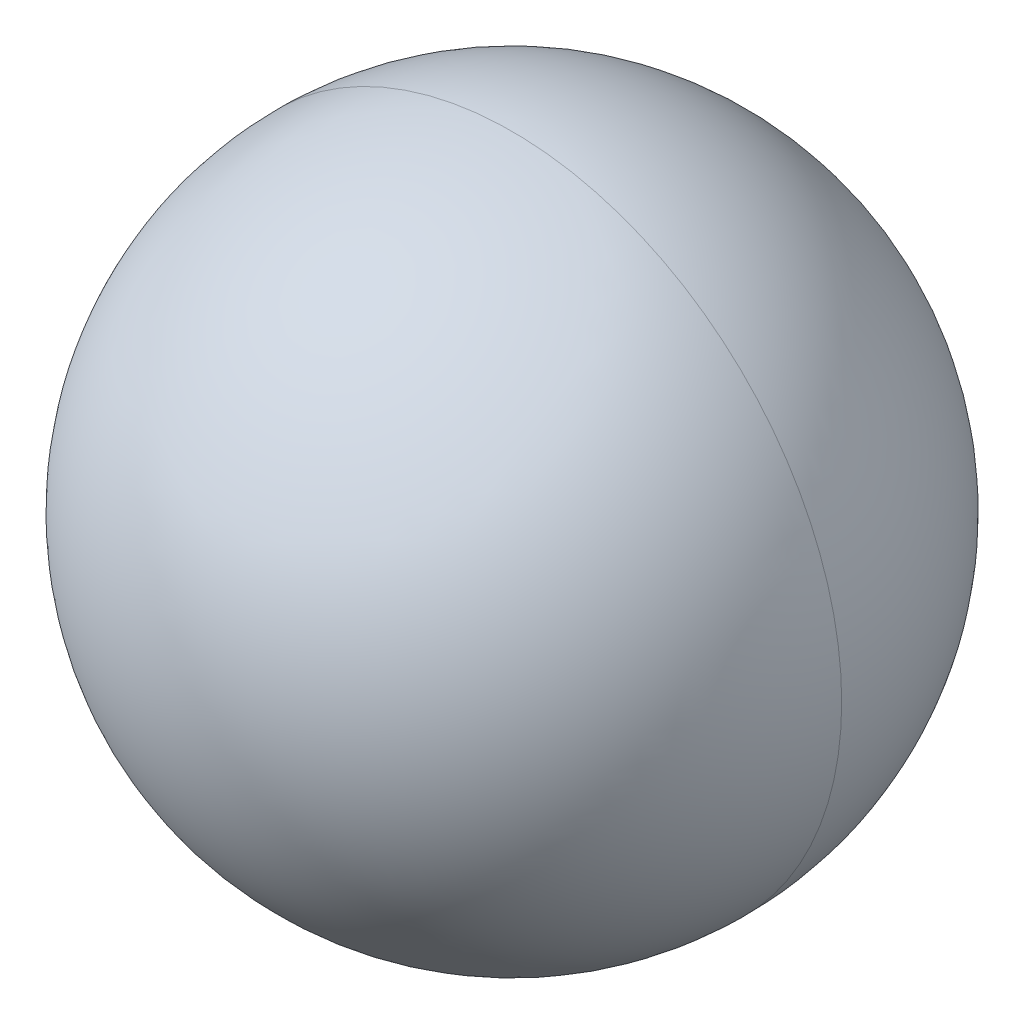
ISO-10303-21;
HEADER;
FILE_DESCRIPTION(('STEP AP214'),'2;1');
FILE_NAME('part.step','',(''),(''),'','','');
FILE_SCHEMA(('AUTOMOTIVE_DESIGN { 1 0 10303 214 1 1 1 1 }'));
ENDSEC;
DATA;
#1=APPLICATION_CONTEXT('core data for automotive mechanical design processes');
#2=APPLICATION_PROTOCOL_DEFINITION('international standard','automotive_design',2000,#1);
#3=PRODUCT_CONTEXT('',#1,'mechanical');
#4=PRODUCT('Part','Part','',(#3));
#5=PRODUCT_RELATED_PRODUCT_CATEGORY('part','',(#4));
#6=PRODUCT_DEFINITION_FORMATION('','',#4);
#7=PRODUCT_DEFINITION_CONTEXT('part definition',#1,'design');
#8=PRODUCT_DEFINITION('design','',#6,#7);
#9=PRODUCT_DEFINITION_SHAPE('','',#8);
#10=(LENGTH_UNIT() NAMED_UNIT(*) SI_UNIT(.MILLI.,.METRE.));
#11=(NAMED_UNIT(*) PLANE_ANGLE_UNIT() SI_UNIT($,.RADIAN.));
#12=(NAMED_UNIT(*) SI_UNIT($,.STERADIAN.) SOLID_ANGLE_UNIT());
#13=UNCERTAINTY_MEASURE_WITH_UNIT(LENGTH_MEASURE(1.E-05),#10,'distance_accuracy_value','');
#14=(GEOMETRIC_REPRESENTATION_CONTEXT(3) GLOBAL_UNCERTAINTY_ASSIGNED_CONTEXT((#13)) GLOBAL_UNIT_ASSIGNED_CONTEXT((#10,
#11,#12)) REPRESENTATION_CONTEXT('',''));
#15=CARTESIAN_POINT('',(0.,0.,0.));
#16=DIRECTION('',(0.,0.,1.));
#17=DIRECTION('',(1.,0.,0.));
#18=AXIS2_PLACEMENT_3D('',#15,#16,#17);
#19=CARTESIAN_POINT('',(0.,0.,0.));
#20=DIRECTION('',(1.,0.,0.));
#21=DIRECTION('',(0.,0.,-1.));
#22=AXIS2_PLACEMENT_3D('',#19,#20,#21);
#23=SPHERICAL_SURFACE('',#22,4.5);
#24=CARTESIAN_POINT('',(0.,0.,0.));
#25=DIRECTION('',(0.,0.,1.));
#26=DIRECTION('',(1.,0.,0.));
#27=AXIS2_PLACEMENT_3D('',#24,#25,#26);
#28=CIRCLE('',#27,4.5);
#29=CARTESIAN_POINT('',(4.5,0.,0.));
#30=VERTEX_POINT('',#29);
#31=CARTESIAN_POINT('',(-4.5,0.,0.));
#32=VERTEX_POINT('',#31);
#33=EDGE_CURVE('E11',#30,#32,#28,.T.);
#34=ORIENTED_EDGE('',*,*,#33,.T.);
#35=CARTESIAN_POINT('',(0.,0.,0.));
#36=DIRECTION('',(0.,0.,-1.));
#37=DIRECTION('',(1.,0.,0.));
#38=AXIS2_PLACEMENT_3D('',#35,#36,#37);
#39=CIRCLE('',#38,4.5);
#40=EDGE_CURVE('E25',#30,#32,#39,.T.);
#41=ORIENTED_EDGE('',*,*,#40,.F.);
#42=EDGE_LOOP('',(#34,#41));
#43=FACE_BOUND('',#42,.T.);
#44=ADVANCED_FACE('F17',(#43),#23,.T.);
#45=CARTESIAN_POINT('',(0.,0.,0.));
#46=DIRECTION('',(1.,0.,0.));
#47=DIRECTION('',(0.,0.,1.));
#48=AXIS2_PLACEMENT_3D('',#45,#46,#47);
#49=SPHERICAL_SURFACE('',#48,4.5);
#50=ORIENTED_EDGE('',*,*,#33,.F.);
#51=ORIENTED_EDGE('',*,*,#40,.T.);
#52=EDGE_LOOP('',(#50,#51));
#53=FACE_BOUND('',#52,.T.);
#54=ADVANCED_FACE('F33',(#53),#49,.T.);
#55=CLOSED_SHELL('',(#44,#54));
#56=MANIFOLD_SOLID_BREP('B1',#55);
#57=ADVANCED_BREP_SHAPE_REPRESENTATION('',(#18,#56),#14);
#58=SHAPE_DEFINITION_REPRESENTATION(#9,#57);
ENDSEC;
END-ISO-10303-21;
